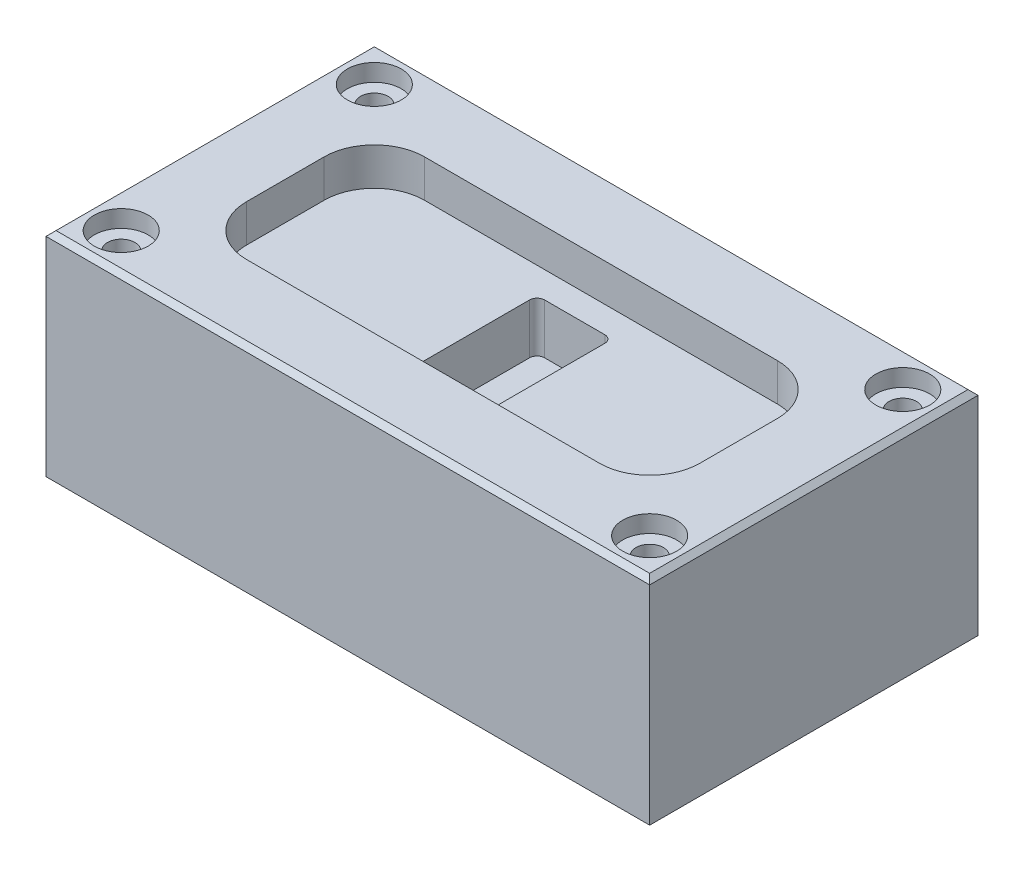
ISO-10303-21;
HEADER;
FILE_DESCRIPTION(('STEP AP214'),'2;1');
FILE_NAME('part.step','',(''),(''),'','','');
FILE_SCHEMA(('AUTOMOTIVE_DESIGN { 1 0 10303 214 1 1 1 1 }'));
ENDSEC;
DATA;
#1=APPLICATION_CONTEXT('core data for automotive mechanical design processes');
#2=APPLICATION_PROTOCOL_DEFINITION('international standard','automotive_design',2000,#1);
#3=PRODUCT_CONTEXT('',#1,'mechanical');
#4=PRODUCT('Part','Part','',(#3));
#5=PRODUCT_RELATED_PRODUCT_CATEGORY('part','',(#4));
#6=PRODUCT_DEFINITION_FORMATION('','',#4);
#7=PRODUCT_DEFINITION_CONTEXT('part definition',#1,'design');
#8=PRODUCT_DEFINITION('design','',#6,#7);
#9=PRODUCT_DEFINITION_SHAPE('','',#8);
#10=(LENGTH_UNIT() NAMED_UNIT(*) SI_UNIT(.MILLI.,.METRE.));
#11=(NAMED_UNIT(*) PLANE_ANGLE_UNIT() SI_UNIT($,.RADIAN.));
#12=(NAMED_UNIT(*) SI_UNIT($,.STERADIAN.) SOLID_ANGLE_UNIT());
#13=UNCERTAINTY_MEASURE_WITH_UNIT(LENGTH_MEASURE(1.E-05),#10,'distance_accuracy_value','');
#14=(GEOMETRIC_REPRESENTATION_CONTEXT(3) GLOBAL_UNCERTAINTY_ASSIGNED_CONTEXT((#13)) GLOBAL_UNIT_ASSIGNED_CONTEXT((#10,
#11,#12)) REPRESENTATION_CONTEXT('',''));
#15=CARTESIAN_POINT('',(0.,0.,0.));
#16=DIRECTION('',(0.,0.,1.));
#17=DIRECTION('',(1.,0.,0.));
#18=AXIS2_PLACEMENT_3D('',#15,#16,#17);
#19=CARTESIAN_POINT('',(120.382671357333,85.,65.4738352375261));
#20=DIRECTION('',(-1.,0.,0.));
#21=DIRECTION('',(0.,0.,1.));
#22=AXIS2_PLACEMENT_3D('',#19,#20,#21);
#23=PLANE('',#22);
#24=DIRECTION('',(0.,-1.,0.));
#25=VECTOR('',#24,1.);
#26=CARTESIAN_POINT('',(120.382671357333,85.,-65.4738352375261));
#27=LINE('',#26,#25);
#28=CARTESIAN_POINT('',(120.382671357333,82.9999999999999,-65.4738352375261));
#29=VERTEX_POINT('',#28);
#30=CARTESIAN_POINT('',(120.382671357333,0.,-65.4738352375261));
#31=VERTEX_POINT('',#30);
#32=EDGE_CURVE('E423',#29,#31,#27,.T.);
#33=ORIENTED_EDGE('',*,*,#32,.F.);
#34=DIRECTION('',(0.,0.,1.));
#35=VECTOR('',#34,1.);
#36=CARTESIAN_POINT('',(120.382671357333,82.9999999999999,65.4738352375261));
#37=LINE('',#36,#35);
#38=CARTESIAN_POINT('',(120.382671357333,82.9999999999999,65.4738352375261));
#39=VERTEX_POINT('',#38);
#40=EDGE_CURVE('E495',#29,#39,#37,.T.);
#41=ORIENTED_EDGE('',*,*,#40,.T.);
#42=DIRECTION('',(0.,-1.,0.));
#43=VECTOR('',#42,1.);
#44=CARTESIAN_POINT('',(120.382671357333,85.,65.4738352375261));
#45=LINE('',#44,#43);
#46=CARTESIAN_POINT('',(120.382671357333,0.,65.4738352375261));
#47=VERTEX_POINT('',#46);
#48=EDGE_CURVE('E414',#39,#47,#45,.T.);
#49=ORIENTED_EDGE('',*,*,#48,.T.);
#50=DIRECTION('',(0.,0.,-1.));
#51=VECTOR('',#50,1.);
#52=CARTESIAN_POINT('',(120.382671357333,0.,65.4738352375261));
#53=LINE('',#52,#51);
#54=EDGE_CURVE('E384',#47,#31,#53,.T.);
#55=ORIENTED_EDGE('',*,*,#54,.T.);
#56=EDGE_LOOP('',(#33,#41,#49,#55));
#57=FACE_BOUND('',#56,.T.);
#58=ADVANCED_FACE('F41',(#57),#23,.F.);
#59=CARTESIAN_POINT('',(-120.382671357333,85.,-65.4738352375261));
#60=DIRECTION('',(0.,0.,1.));
#61=DIRECTION('',(1.,0.,0.));
#62=AXIS2_PLACEMENT_3D('',#59,#60,#61);
#63=PLANE('',#62);
#64=DIRECTION('',(0.,-1.,0.));
#65=VECTOR('',#64,1.);
#66=CARTESIAN_POINT('',(-120.382671357333,85.,-65.4738352375261));
#67=LINE('',#66,#65);
#68=CARTESIAN_POINT('',(-120.382671357333,82.9999999999999,-65.4738352375261));
#69=VERTEX_POINT('',#68);
#70=CARTESIAN_POINT('',(-120.382671357333,0.,-65.4738352375261));
#71=VERTEX_POINT('',#70);
#72=EDGE_CURVE('E420',#69,#71,#67,.T.);
#73=ORIENTED_EDGE('',*,*,#72,.F.);
#74=DIRECTION('',(1.,0.,0.));
#75=VECTOR('',#74,1.);
#76=CARTESIAN_POINT('',(-120.382671357333,82.9999999999999,-65.4738352375261));
#77=LINE('',#76,#75);
#78=EDGE_CURVE('E52',#69,#29,#77,.T.);
#79=ORIENTED_EDGE('',*,*,#78,.T.);
#80=ORIENTED_EDGE('',*,*,#32,.T.);
#81=DIRECTION('',(-1.,0.,0.));
#82=VECTOR('',#81,1.);
#83=CARTESIAN_POINT('',(-120.382671357333,0.,-65.4738352375261));
#84=LINE('',#83,#82);
#85=EDGE_CURVE('E402',#31,#71,#84,.T.);
#86=ORIENTED_EDGE('',*,*,#85,.T.);
#87=EDGE_LOOP('',(#73,#79,#80,#86));
#88=FACE_BOUND('',#87,.T.);
#89=ADVANCED_FACE('F523',(#88),#63,.F.);
#90=CARTESIAN_POINT('',(-120.382671357333,85.,65.4738352375261));
#91=DIRECTION('',(1.,0.,0.));
#92=DIRECTION('',(0.,0.,-1.));
#93=AXIS2_PLACEMENT_3D('',#90,#91,#92);
#94=PLANE('',#93);
#95=DIRECTION('',(0.,-1.,0.));
#96=VECTOR('',#95,1.);
#97=CARTESIAN_POINT('',(-120.382671357333,85.,65.4738352375261));
#98=LINE('',#97,#96);
#99=CARTESIAN_POINT('',(-120.382671357333,82.9999999999999,65.4738352375261));
#100=VERTEX_POINT('',#99);
#101=CARTESIAN_POINT('',(-120.382671357333,0.,65.4738352375261));
#102=VERTEX_POINT('',#101);
#103=EDGE_CURVE('E417',#100,#102,#98,.T.);
#104=ORIENTED_EDGE('',*,*,#103,.F.);
#105=DIRECTION('',(0.,0.,-1.));
#106=VECTOR('',#105,1.);
#107=CARTESIAN_POINT('',(-120.382671357333,82.9999999999999,65.4738352375261));
#108=LINE('',#107,#106);
#109=EDGE_CURVE('E11',#100,#69,#108,.T.);
#110=ORIENTED_EDGE('',*,*,#109,.T.);
#111=ORIENTED_EDGE('',*,*,#72,.T.);
#112=DIRECTION('',(0.,0.,1.));
#113=VECTOR('',#112,1.);
#114=CARTESIAN_POINT('',(-120.382671357333,0.,65.4738352375261));
#115=LINE('',#114,#113);
#116=EDGE_CURVE('E406',#71,#102,#115,.T.);
#117=ORIENTED_EDGE('',*,*,#116,.T.);
#118=EDGE_LOOP('',(#104,#110,#111,#117));
#119=FACE_BOUND('',#118,.T.);
#120=ADVANCED_FACE('F532',(#119),#94,.F.);
#121=CARTESIAN_POINT('',(-120.382671357333,85.,65.4738352375261));
#122=DIRECTION('',(0.,0.,-1.));
#123=DIRECTION('',(-1.,0.,0.));
#124=AXIS2_PLACEMENT_3D('',#121,#122,#123);
#125=PLANE('',#124);
#126=ORIENTED_EDGE('',*,*,#48,.F.);
#127=DIRECTION('',(-1.,0.,0.));
#128=VECTOR('',#127,1.);
#129=CARTESIAN_POINT('',(-120.382671357333,82.9999999999999,65.4738352375261));
#130=LINE('',#129,#128);
#131=EDGE_CURVE('E491',#39,#100,#130,.T.);
#132=ORIENTED_EDGE('',*,*,#131,.T.);
#133=ORIENTED_EDGE('',*,*,#103,.T.);
#134=DIRECTION('',(1.,0.,0.));
#135=VECTOR('',#134,1.);
#136=CARTESIAN_POINT('',(-120.382671357333,0.,65.4738352375261));
#137=LINE('',#136,#135);
#138=EDGE_CURVE('E410',#102,#47,#137,.T.);
#139=ORIENTED_EDGE('',*,*,#138,.T.);
#140=EDGE_LOOP('',(#126,#132,#133,#139));
#141=FACE_BOUND('',#140,.T.);
#142=ADVANCED_FACE('F534',(#141),#125,.F.);
#143=CARTESIAN_POINT('',(0.,85.,0.));
#144=DIRECTION('',(0.,-1.,0.));
#145=DIRECTION('',(0.,0.,-1.));
#146=AXIS2_PLACEMENT_3D('',#143,#144,#145);
#147=PLANE('',#146);
#148=DIRECTION('',(0.,0.,1.));
#149=VECTOR('',#148,1.);
#150=CARTESIAN_POINT('',(-118.382671357333,85.,0.));
#151=LINE('',#150,#149);
#152=CARTESIAN_POINT('',(-118.382671357333,85.,-63.4738352375261));
#153=VERTEX_POINT('',#152);
#154=CARTESIAN_POINT('',(-118.382671357333,85.,63.4738352375261));
#155=VERTEX_POINT('',#154);
#156=EDGE_CURVE('E478',#153,#155,#151,.T.);
#157=ORIENTED_EDGE('',*,*,#156,.T.);
#158=DIRECTION('',(1.,0.,0.));
#159=VECTOR('',#158,1.);
#160=CARTESIAN_POINT('',(0.,85.,63.4738352375261));
#161=LINE('',#160,#159);
#162=CARTESIAN_POINT('',(118.382671357333,85.,63.4738352375261));
#163=VERTEX_POINT('',#162);
#164=EDGE_CURVE('E487',#155,#163,#161,.T.);
#165=ORIENTED_EDGE('',*,*,#164,.T.);
#166=DIRECTION('',(0.,0.,-1.));
#167=VECTOR('',#166,1.);
#168=CARTESIAN_POINT('',(118.382671357333,85.,0.));
#169=LINE('',#168,#167);
#170=CARTESIAN_POINT('',(118.382671357333,85.,-63.4738352375261));
#171=VERTEX_POINT('',#170);
#172=EDGE_CURVE('E484',#163,#171,#169,.T.);
#173=ORIENTED_EDGE('',*,*,#172,.T.);
#174=DIRECTION('',(-1.,0.,0.));
#175=VECTOR('',#174,1.);
#176=CARTESIAN_POINT('',(0.,85.,-63.4738352375261));
#177=LINE('',#176,#175);
#178=EDGE_CURVE('E481',#171,#153,#177,.T.);
#179=ORIENTED_EDGE('',*,*,#178,.T.);
#180=EDGE_LOOP('',(#157,#165,#173,#179));
#181=FACE_BOUND('',#180,.T.);
#182=CARTESIAN_POINT('',(-105.382671357333,85.,-50.4738352375261));
#183=DIRECTION('',(0.,1.,0.));
#184=DIRECTION('',(0.,0.,1.));
#185=AXIS2_PLACEMENT_3D('',#182,#183,#184);
#186=CIRCLE('',#185,10.74);
#187=CARTESIAN_POINT('',(-105.382671357333,85.,-39.7338352375261));
#188=VERTEX_POINT('',#187);
#189=EDGE_CURVE('E302',#188,#188,#186,.T.);
#190=ORIENTED_EDGE('',*,*,#189,.F.);
#191=EDGE_LOOP('',(#190));
#192=FACE_BOUND('',#191,.T.);
#193=CARTESIAN_POINT('',(-105.382671357333,85.,50.4738352375261));
#194=DIRECTION('',(0.,1.,0.));
#195=DIRECTION('',(0.,0.,1.));
#196=AXIS2_PLACEMENT_3D('',#193,#194,#195);
#197=CIRCLE('',#196,10.74);
#198=CARTESIAN_POINT('',(-105.382671357333,85.,61.2138352375261));
#199=VERTEX_POINT('',#198);
#200=EDGE_CURVE('E318',#199,#199,#197,.T.);
#201=ORIENTED_EDGE('',*,*,#200,.F.);
#202=EDGE_LOOP('',(#201));
#203=FACE_BOUND('',#202,.T.);
#204=CARTESIAN_POINT('',(105.382671357333,85.,-50.4738352375261));
#205=DIRECTION('',(0.,1.,0.));
#206=DIRECTION('',(0.,0.,1.));
#207=AXIS2_PLACEMENT_3D('',#204,#205,#206);
#208=CIRCLE('',#207,10.74);
#209=CARTESIAN_POINT('',(105.382671357333,85.,-39.7338352375261));
#210=VERTEX_POINT('',#209);
#211=EDGE_CURVE('E334',#210,#210,#208,.T.);
#212=ORIENTED_EDGE('',*,*,#211,.F.);
#213=EDGE_LOOP('',(#212));
#214=FACE_BOUND('',#213,.T.);
#215=CARTESIAN_POINT('',(105.382671357333,85.,50.4738352375261));
#216=DIRECTION('',(0.,1.,0.));
#217=DIRECTION('',(0.,0.,1.));
#218=AXIS2_PLACEMENT_3D('',#215,#216,#217);
#219=CIRCLE('',#218,10.74);
#220=CARTESIAN_POINT('',(105.382671357333,85.,61.2138352375261));
#221=VERTEX_POINT('',#220);
#222=EDGE_CURVE('E350',#221,#221,#219,.T.);
#223=ORIENTED_EDGE('',*,*,#222,.F.);
#224=EDGE_LOOP('',(#223));
#225=FACE_BOUND('',#224,.T.);
#226=DIRECTION('',(0.,0.,-1.));
#227=VECTOR('',#226,1.);
#228=CARTESIAN_POINT('',(90.3826713573335,85.,35.4738352375261));
#229=LINE('',#228,#227);
#230=CARTESIAN_POINT('',(90.3826713573335,85.,15.4738352375261));
#231=VERTEX_POINT('',#230);
#232=CARTESIAN_POINT('',(90.3826713573335,85.,-15.4738352375261));
#233=VERTEX_POINT('',#232);
#234=EDGE_CURVE('E388',#231,#233,#229,.T.);
#235=ORIENTED_EDGE('',*,*,#234,.F.);
#236=CARTESIAN_POINT('',(70.3826713573335,85.,15.4738352375261));
#237=DIRECTION('',(0.,-1.,0.));
#238=DIRECTION('',(0.,0.,-1.));
#239=AXIS2_PLACEMENT_3D('',#236,#237,#238);
#240=CIRCLE('',#239,20.);
#241=CARTESIAN_POINT('',(70.3826713573335,85.,35.4738352375261));
#242=VERTEX_POINT('',#241);
#243=EDGE_CURVE('E469',#231,#242,#240,.T.);
#244=ORIENTED_EDGE('',*,*,#243,.T.);
#245=DIRECTION('',(1.,0.,0.));
#246=VECTOR('',#245,1.);
#247=CARTESIAN_POINT('',(-90.3826713573335,85.,35.4738352375261));
#248=LINE('',#247,#246);
#249=CARTESIAN_POINT('',(-70.3826713573335,85.,35.4738352375261));
#250=VERTEX_POINT('',#249);
#251=EDGE_CURVE('E366',#250,#242,#248,.T.);
#252=ORIENTED_EDGE('',*,*,#251,.F.);
#253=CARTESIAN_POINT('',(-70.3826713573335,85.,15.4738352375261));
#254=DIRECTION('',(0.,-1.,0.));
#255=DIRECTION('',(0.,0.,-1.));
#256=AXIS2_PLACEMENT_3D('',#253,#254,#255);
#257=CIRCLE('',#256,20.);
#258=CARTESIAN_POINT('',(-90.3826713573335,85.,15.4738352375261));
#259=VERTEX_POINT('',#258);
#260=EDGE_CURVE('E466',#250,#259,#257,.T.);
#261=ORIENTED_EDGE('',*,*,#260,.T.);
#262=DIRECTION('',(0.,0.,1.));
#263=VECTOR('',#262,1.);
#264=CARTESIAN_POINT('',(-90.3826713573335,85.,-35.4738352375261));
#265=LINE('',#264,#263);
#266=CARTESIAN_POINT('',(-90.3826713573335,85.,-15.4738352375261));
#267=VERTEX_POINT('',#266);
#268=EDGE_CURVE('E372',#267,#259,#265,.T.);
#269=ORIENTED_EDGE('',*,*,#268,.F.);
#270=CARTESIAN_POINT('',(-70.3826713573335,85.,-15.4738352375261));
#271=DIRECTION('',(0.,-1.,0.));
#272=DIRECTION('',(0.,0.,-1.));
#273=AXIS2_PLACEMENT_3D('',#270,#271,#272);
#274=CIRCLE('',#273,20.);
#275=CARTESIAN_POINT('',(-70.3826713573335,85.,-35.4738352375261));
#276=VERTEX_POINT('',#275);
#277=EDGE_CURVE('E475',#267,#276,#274,.T.);
#278=ORIENTED_EDGE('',*,*,#277,.T.);
#279=DIRECTION('',(-1.,0.,0.));
#280=VECTOR('',#279,1.);
#281=CARTESIAN_POINT('',(90.3826713573335,85.,-35.4738352375261));
#282=LINE('',#281,#280);
#283=CARTESIAN_POINT('',(70.3826713573335,85.,-35.4738352375261));
#284=VERTEX_POINT('',#283);
#285=EDGE_CURVE('E392',#284,#276,#282,.T.);
#286=ORIENTED_EDGE('',*,*,#285,.F.);
#287=CARTESIAN_POINT('',(70.3826713573335,85.,-15.4738352375261));
#288=DIRECTION('',(0.,-1.,0.));
#289=DIRECTION('',(0.,0.,-1.));
#290=AXIS2_PLACEMENT_3D('',#287,#288,#289);
#291=CIRCLE('',#290,20.);
#292=EDGE_CURVE('E472',#284,#233,#291,.T.);
#293=ORIENTED_EDGE('',*,*,#292,.T.);
#294=EDGE_LOOP('',(#235,#244,#252,#261,#269,#278,#286,#293));
#295=FACE_BOUND('',#294,.T.);
#296=ADVANCED_FACE('F542',(#181,#192,#203,#214,#225,#295),#147,.F.);
#297=CARTESIAN_POINT('',(0.,0.,0.));
#298=DIRECTION('',(0.,-1.,0.));
#299=DIRECTION('',(0.,0.,-1.));
#300=AXIS2_PLACEMENT_3D('',#297,#298,#299);
#301=PLANE('',#300);
#302=ORIENTED_EDGE('',*,*,#54,.F.);
#303=ORIENTED_EDGE('',*,*,#138,.F.);
#304=ORIENTED_EDGE('',*,*,#116,.F.);
#305=ORIENTED_EDGE('',*,*,#85,.F.);
#306=EDGE_LOOP('',(#302,#303,#304,#305));
#307=FACE_BOUND('',#306,.T.);
#308=ADVANCED_FACE('F530',(#307),#301,.T.);
#309=CARTESIAN_POINT('',(-90.3826713573335,70.,35.4738352375261));
#310=DIRECTION('',(0.,0.,1.));
#311=DIRECTION('',(1.,0.,0.));
#312=AXIS2_PLACEMENT_3D('',#309,#310,#311);
#313=PLANE('',#312);
#314=DIRECTION('',(1.,0.,0.));
#315=VECTOR('',#314,1.);
#316=CARTESIAN_POINT('',(-90.3826713573335,70.,35.4738352375261));
#317=LINE('',#316,#315);
#318=CARTESIAN_POINT('',(-70.3826713573335,70.,35.4738352375261));
#319=VERTEX_POINT('',#318);
#320=CARTESIAN_POINT('',(70.3826713573335,70.,35.4738352375261));
#321=VERTEX_POINT('',#320);
#322=EDGE_CURVE('E367',#319,#321,#317,.T.);
#323=ORIENTED_EDGE('',*,*,#322,.F.);
#324=DIRECTION('',(0.,1.,0.));
#325=VECTOR('',#324,1.);
#326=CARTESIAN_POINT('',(-70.3826713573335,85.,35.4738352375261));
#327=LINE('',#326,#325);
#328=EDGE_CURVE('E429',#319,#250,#327,.T.);
#329=ORIENTED_EDGE('',*,*,#328,.T.);
#330=ORIENTED_EDGE('',*,*,#251,.T.);
#331=DIRECTION('',(0.,1.,0.));
#332=VECTOR('',#331,1.);
#333=CARTESIAN_POINT('',(70.3826713573335,70.,35.4738352375261));
#334=LINE('',#333,#332);
#335=EDGE_CURVE('E426',#242,#321,#334,.F.);
#336=ORIENTED_EDGE('',*,*,#335,.T.);
#337=EDGE_LOOP('',(#323,#329,#330,#336));
#338=FACE_BOUND('',#337,.T.);
#339=ADVANCED_FACE('F588',(#338),#313,.F.);
#340=CARTESIAN_POINT('',(-90.3826713573335,70.,-35.4738352375261));
#341=DIRECTION('',(-1.,0.,0.));
#342=DIRECTION('',(0.,0.,1.));
#343=AXIS2_PLACEMENT_3D('',#340,#341,#342);
#344=PLANE('',#343);
#345=ORIENTED_EDGE('',*,*,#268,.T.);
#346=DIRECTION('',(0.,1.,0.));
#347=VECTOR('',#346,1.);
#348=CARTESIAN_POINT('',(-90.3826713573335,70.,15.4738352375261));
#349=LINE('',#348,#347);
#350=CARTESIAN_POINT('',(-90.3826713573335,70.,15.4738352375261));
#351=VERTEX_POINT('',#350);
#352=EDGE_CURVE('E437',#259,#351,#349,.F.);
#353=ORIENTED_EDGE('',*,*,#352,.T.);
#354=DIRECTION('',(0.,0.,1.));
#355=VECTOR('',#354,1.);
#356=CARTESIAN_POINT('',(-90.3826713573335,70.,-35.4738352375261));
#357=LINE('',#356,#355);
#358=CARTESIAN_POINT('',(-90.3826713573335,70.,-15.4738352375261));
#359=VERTEX_POINT('',#358);
#360=EDGE_CURVE('E380',#359,#351,#357,.T.);
#361=ORIENTED_EDGE('',*,*,#360,.F.);
#362=DIRECTION('',(0.,1.,0.));
#363=VECTOR('',#362,1.);
#364=CARTESIAN_POINT('',(-90.3826713573335,85.,-15.4738352375261));
#365=LINE('',#364,#363);
#366=EDGE_CURVE('E433',#359,#267,#365,.T.);
#367=ORIENTED_EDGE('',*,*,#366,.T.);
#368=EDGE_LOOP('',(#345,#353,#361,#367));
#369=FACE_BOUND('',#368,.T.);
#370=ADVANCED_FACE('F579',(#369),#344,.F.);
#371=CARTESIAN_POINT('',(90.3826713573335,70.,-35.4738352375261));
#372=DIRECTION('',(0.,0.,-1.));
#373=DIRECTION('',(-1.,0.,0.));
#374=AXIS2_PLACEMENT_3D('',#371,#372,#373);
#375=PLANE('',#374);
#376=DIRECTION('',(-1.,0.,0.));
#377=VECTOR('',#376,1.);
#378=CARTESIAN_POINT('',(90.3826713573335,70.,-35.4738352375261));
#379=LINE('',#378,#377);
#380=CARTESIAN_POINT('',(70.3826713573335,70.,-35.4738352375261));
#381=VERTEX_POINT('',#380);
#382=CARTESIAN_POINT('',(-70.3826713573335,70.,-35.4738352375261));
#383=VERTEX_POINT('',#382);
#384=EDGE_CURVE('E376',#381,#383,#379,.T.);
#385=ORIENTED_EDGE('',*,*,#384,.F.);
#386=DIRECTION('',(0.,1.,0.));
#387=VECTOR('',#386,1.);
#388=CARTESIAN_POINT('',(70.3826713573335,85.,-35.4738352375261));
#389=LINE('',#388,#387);
#390=EDGE_CURVE('E462',#381,#284,#389,.T.);
#391=ORIENTED_EDGE('',*,*,#390,.T.);
#392=ORIENTED_EDGE('',*,*,#285,.T.);
#393=DIRECTION('',(0.,1.,0.));
#394=VECTOR('',#393,1.);
#395=CARTESIAN_POINT('',(-70.3826713573335,70.,-35.4738352375261));
#396=LINE('',#395,#394);
#397=EDGE_CURVE('E459',#276,#383,#396,.F.);
#398=ORIENTED_EDGE('',*,*,#397,.T.);
#399=EDGE_LOOP('',(#385,#391,#392,#398));
#400=FACE_BOUND('',#399,.T.);
#401=ADVANCED_FACE('F571',(#400),#375,.F.);
#402=CARTESIAN_POINT('',(90.3826713573335,70.,35.4738352375261));
#403=DIRECTION('',(1.,0.,0.));
#404=DIRECTION('',(0.,0.,-1.));
#405=AXIS2_PLACEMENT_3D('',#402,#403,#404);
#406=PLANE('',#405);
#407=DIRECTION('',(0.,0.,-1.));
#408=VECTOR('',#407,1.);
#409=CARTESIAN_POINT('',(90.3826713573335,70.,35.4738352375261));
#410=LINE('',#409,#408);
#411=CARTESIAN_POINT('',(90.3826713573335,70.,15.4738352375261));
#412=VERTEX_POINT('',#411);
#413=CARTESIAN_POINT('',(90.3826713573335,70.,-15.4738352375261));
#414=VERTEX_POINT('',#413);
#415=EDGE_CURVE('E371',#412,#414,#410,.T.);
#416=ORIENTED_EDGE('',*,*,#415,.F.);
#417=DIRECTION('',(0.,1.,0.));
#418=VECTOR('',#417,1.);
#419=CARTESIAN_POINT('',(90.3826713573335,85.,15.4738352375261));
#420=LINE('',#419,#418);
#421=EDGE_CURVE('E455',#412,#231,#420,.T.);
#422=ORIENTED_EDGE('',*,*,#421,.T.);
#423=ORIENTED_EDGE('',*,*,#234,.T.);
#424=DIRECTION('',(0.,1.,0.));
#425=VECTOR('',#424,1.);
#426=CARTESIAN_POINT('',(90.3826713573335,70.,-15.4738352375261));
#427=LINE('',#426,#425);
#428=EDGE_CURVE('E452',#233,#414,#427,.F.);
#429=ORIENTED_EDGE('',*,*,#428,.T.);
#430=EDGE_LOOP('',(#416,#422,#423,#429));
#431=FACE_BOUND('',#430,.T.);
#432=ADVANCED_FACE('F560',(#431),#406,.F.);
#433=CARTESIAN_POINT('',(0.,70.,0.));
#434=DIRECTION('',(0.,1.,0.));
#435=DIRECTION('',(0.,0.,1.));
#436=AXIS2_PLACEMENT_3D('',#433,#434,#435);
#437=PLANE('',#436);
#438=CARTESIAN_POINT('',(-12.,70.,22.));
#439=DIRECTION('',(0.,1.,0.));
#440=DIRECTION('',(0.,0.,-1.));
#441=AXIS2_PLACEMENT_3D('',#438,#439,#440);
#442=CIRCLE('',#441,3.);
#443=CARTESIAN_POINT('',(-15.,70.,22.));
#444=VERTEX_POINT('',#443);
#445=CARTESIAN_POINT('',(-12.,70.,25.));
#446=VERTEX_POINT('',#445);
#447=EDGE_CURVE('E212',#444,#446,#442,.T.);
#448=ORIENTED_EDGE('',*,*,#447,.F.);
#449=DIRECTION('',(0.,0.,1.));
#450=VECTOR('',#449,1.);
#451=CARTESIAN_POINT('',(-15.,70.,22.));
#452=LINE('',#451,#450);
#453=CARTESIAN_POINT('',(-15.,70.,-22.));
#454=VERTEX_POINT('',#453);
#455=EDGE_CURVE('E233',#454,#444,#452,.T.);
#456=ORIENTED_EDGE('',*,*,#455,.F.);
#457=CARTESIAN_POINT('',(-12.,70.,-22.));
#458=DIRECTION('',(0.,1.,0.));
#459=DIRECTION('',(0.,0.,-1.));
#460=AXIS2_PLACEMENT_3D('',#457,#458,#459);
#461=CIRCLE('',#460,3.);
#462=CARTESIAN_POINT('',(-12.,70.,-25.));
#463=VERTEX_POINT('',#462);
#464=EDGE_CURVE('E60',#463,#454,#461,.T.);
#465=ORIENTED_EDGE('',*,*,#464,.F.);
#466=DIRECTION('',(-1.,0.,0.));
#467=VECTOR('',#466,1.);
#468=CARTESIAN_POINT('',(-12.,70.,-25.));
#469=LINE('',#468,#467);
#470=CARTESIAN_POINT('',(12.,70.,-25.));
#471=VERTEX_POINT('',#470);
#472=EDGE_CURVE('E275',#471,#463,#469,.T.);
#473=ORIENTED_EDGE('',*,*,#472,.F.);
#474=CARTESIAN_POINT('',(12.,70.,-22.));
#475=DIRECTION('',(0.,1.,0.));
#476=DIRECTION('',(0.,0.,-1.));
#477=AXIS2_PLACEMENT_3D('',#474,#475,#476);
#478=CIRCLE('',#477,3.);
#479=CARTESIAN_POINT('',(15.,70.,-22.));
#480=VERTEX_POINT('',#479);
#481=EDGE_CURVE('E271',#480,#471,#478,.T.);
#482=ORIENTED_EDGE('',*,*,#481,.F.);
#483=DIRECTION('',(0.,0.,-1.));
#484=VECTOR('',#483,1.);
#485=CARTESIAN_POINT('',(15.,70.,22.));
#486=LINE('',#485,#484);
#487=CARTESIAN_POINT('',(15.,70.,22.));
#488=VERTEX_POINT('',#487);
#489=EDGE_CURVE('E267',#488,#480,#486,.T.);
#490=ORIENTED_EDGE('',*,*,#489,.F.);
#491=CARTESIAN_POINT('',(12.,70.,22.));
#492=DIRECTION('',(0.,1.,0.));
#493=DIRECTION('',(0.,0.,1.));
#494=AXIS2_PLACEMENT_3D('',#491,#492,#493);
#495=CIRCLE('',#494,3.);
#496=CARTESIAN_POINT('',(12.,70.,25.));
#497=VERTEX_POINT('',#496);
#498=EDGE_CURVE('E263',#497,#488,#495,.T.);
#499=ORIENTED_EDGE('',*,*,#498,.F.);
#500=DIRECTION('',(1.,0.,0.));
#501=VECTOR('',#500,1.);
#502=CARTESIAN_POINT('',(-12.,70.,25.));
#503=LINE('',#502,#501);
#504=EDGE_CURVE('E260',#446,#497,#503,.T.);
#505=ORIENTED_EDGE('',*,*,#504,.F.);
#506=EDGE_LOOP('',(#448,#456,#465,#473,#482,#490,#499,#505));
#507=FACE_BOUND('',#506,.T.);
#508=ORIENTED_EDGE('',*,*,#360,.T.);
#509=CARTESIAN_POINT('',(-70.3826713573335,70.,15.4738352375261));
#510=DIRECTION('',(0.,1.,0.));
#511=DIRECTION('',(0.,0.,1.));
#512=AXIS2_PLACEMENT_3D('',#509,#510,#511);
#513=CIRCLE('',#512,20.);
#514=EDGE_CURVE('E449',#351,#319,#513,.T.);
#515=ORIENTED_EDGE('',*,*,#514,.T.);
#516=ORIENTED_EDGE('',*,*,#322,.T.);
#517=CARTESIAN_POINT('',(70.3826713573335,70.,15.4738352375261));
#518=DIRECTION('',(0.,1.,0.));
#519=DIRECTION('',(0.,0.,1.));
#520=AXIS2_PLACEMENT_3D('',#517,#518,#519);
#521=CIRCLE('',#520,20.);
#522=EDGE_CURVE('E446',#321,#412,#521,.T.);
#523=ORIENTED_EDGE('',*,*,#522,.T.);
#524=ORIENTED_EDGE('',*,*,#415,.T.);
#525=CARTESIAN_POINT('',(70.3826713573335,70.,-15.4738352375261));
#526=DIRECTION('',(0.,1.,0.));
#527=DIRECTION('',(0.,0.,1.));
#528=AXIS2_PLACEMENT_3D('',#525,#526,#527);
#529=CIRCLE('',#528,20.);
#530=EDGE_CURVE('E443',#414,#381,#529,.T.);
#531=ORIENTED_EDGE('',*,*,#530,.T.);
#532=ORIENTED_EDGE('',*,*,#384,.T.);
#533=CARTESIAN_POINT('',(-70.3826713573335,70.,-15.4738352375261));
#534=DIRECTION('',(0.,1.,0.));
#535=DIRECTION('',(0.,0.,1.));
#536=AXIS2_PLACEMENT_3D('',#533,#534,#535);
#537=CIRCLE('',#536,20.);
#538=EDGE_CURVE('E440',#383,#359,#537,.T.);
#539=ORIENTED_EDGE('',*,*,#538,.T.);
#540=EDGE_LOOP('',(#508,#515,#516,#523,#524,#531,#532,#539));
#541=FACE_BOUND('',#540,.T.);
#542=ADVANCED_FACE('F568',(#507,#541),#437,.T.);
#543=CARTESIAN_POINT('',(105.382671357333,65.,50.4738352375261));
#544=DIRECTION('',(0.,1.,0.));
#545=DIRECTION('',(0.,0.,1.));
#546=AXIS2_PLACEMENT_3D('',#543,#544,#545);
#547=CONICAL_SURFACE('',#546,5.49999999999999,1.02974425867665);
#548=CARTESIAN_POINT('',(105.382671357333,61.6952665953484,50.4738352375261));
#549=VERTEX_POINT('',#548);
#550=VERTEX_LOOP('',#549);
#551=FACE_BOUND('',#550,.T.);
#552=CARTESIAN_POINT('',(105.382671357333,65.,50.4738352375261));
#553=DIRECTION('',(0.,1.,0.));
#554=DIRECTION('',(0.,0.,1.));
#555=AXIS2_PLACEMENT_3D('',#552,#553,#554);
#556=CIRCLE('',#555,5.49999999999999);
#557=CARTESIAN_POINT('',(105.382671357333,65.,55.9738352375261));
#558=VERTEX_POINT('',#557);
#559=EDGE_CURVE('E362',#558,#558,#556,.T.);
#560=ORIENTED_EDGE('',*,*,#559,.T.);
#561=EDGE_LOOP('',(#560));
#562=FACE_BOUND('',#561,.T.);
#563=ADVANCED_FACE('F624',(#551,#562),#547,.F.);
#564=CARTESIAN_POINT('',(105.382671357333,85.,50.4738352375261));
#565=DIRECTION('',(0.,1.,0.));
#566=DIRECTION('',(0.,0.,1.));
#567=AXIS2_PLACEMENT_3D('',#564,#565,#566);
#568=CYLINDRICAL_SURFACE('',#567,5.49999999999999);
#569=ORIENTED_EDGE('',*,*,#559,.F.);
#570=EDGE_LOOP('',(#569));
#571=FACE_BOUND('',#570,.T.);
#572=CARTESIAN_POINT('',(105.382671357333,78.15,50.4738352375261));
#573=DIRECTION('',(0.,1.,0.));
#574=DIRECTION('',(0.,0.,1.));
#575=AXIS2_PLACEMENT_3D('',#572,#573,#574);
#576=CIRCLE('',#575,5.49999999999999);
#577=CARTESIAN_POINT('',(105.382671357333,78.15,55.9738352375261));
#578=VERTEX_POINT('',#577);
#579=EDGE_CURVE('E358',#578,#578,#576,.T.);
#580=ORIENTED_EDGE('',*,*,#579,.T.);
#581=EDGE_LOOP('',(#580));
#582=FACE_BOUND('',#581,.T.);
#583=ADVANCED_FACE('F628',(#571,#582),#568,.F.);
#584=CARTESIAN_POINT('',(110.882671357333,78.15,50.4738352375261));
#585=DIRECTION('',(0.,-1.,0.));
#586=DIRECTION('',(0.,0.,-1.));
#587=AXIS2_PLACEMENT_3D('',#584,#585,#586);
#588=PLANE('',#587);
#589=ORIENTED_EDGE('',*,*,#579,.F.);
#590=EDGE_LOOP('',(#589));
#591=FACE_BOUND('',#590,.T.);
#592=CARTESIAN_POINT('',(105.382671357333,78.15,50.4738352375261));
#593=DIRECTION('',(0.,1.,0.));
#594=DIRECTION('',(0.,0.,1.));
#595=AXIS2_PLACEMENT_3D('',#592,#593,#594);
#596=CIRCLE('',#595,10.74);
#597=CARTESIAN_POINT('',(105.382671357333,78.15,61.2138352375261));
#598=VERTEX_POINT('',#597);
#599=EDGE_CURVE('E354',#598,#598,#596,.T.);
#600=ORIENTED_EDGE('',*,*,#599,.T.);
#601=EDGE_LOOP('',(#600));
#602=FACE_BOUND('',#601,.T.);
#603=ADVANCED_FACE('F632',(#591,#602),#588,.F.);
#604=CARTESIAN_POINT('',(105.382671357333,85.,50.4738352375261));
#605=DIRECTION('',(0.,1.,0.));
#606=DIRECTION('',(0.,0.,1.));
#607=AXIS2_PLACEMENT_3D('',#604,#605,#606);
#608=CYLINDRICAL_SURFACE('',#607,10.74);
#609=ORIENTED_EDGE('',*,*,#599,.F.);
#610=EDGE_LOOP('',(#609));
#611=FACE_BOUND('',#610,.T.);
#612=ORIENTED_EDGE('',*,*,#222,.T.);
#613=EDGE_LOOP('',(#612));
#614=FACE_BOUND('',#613,.T.);
#615=ADVANCED_FACE('F636',(#611,#614),#608,.F.);
#616=CARTESIAN_POINT('',(105.382671357333,65.,-50.4738352375261));
#617=DIRECTION('',(0.,1.,0.));
#618=DIRECTION('',(0.,0.,1.));
#619=AXIS2_PLACEMENT_3D('',#616,#617,#618);
#620=CONICAL_SURFACE('',#619,5.49999999999999,1.02974425867665);
#621=CARTESIAN_POINT('',(105.382671357333,61.6952665953484,-50.4738352375261));
#622=VERTEX_POINT('',#621);
#623=VERTEX_LOOP('',#622);
#624=FACE_BOUND('',#623,.T.);
#625=CARTESIAN_POINT('',(105.382671357333,65.,-50.4738352375261));
#626=DIRECTION('',(0.,1.,0.));
#627=DIRECTION('',(0.,0.,1.));
#628=AXIS2_PLACEMENT_3D('',#625,#626,#627);
#629=CIRCLE('',#628,5.49999999999999);
#630=CARTESIAN_POINT('',(105.382671357333,65.,-44.9738352375262));
#631=VERTEX_POINT('',#630);
#632=EDGE_CURVE('E346',#631,#631,#629,.T.);
#633=ORIENTED_EDGE('',*,*,#632,.T.);
#634=EDGE_LOOP('',(#633));
#635=FACE_BOUND('',#634,.T.);
#636=ADVANCED_FACE('F640',(#624,#635),#620,.F.);
#637=CARTESIAN_POINT('',(105.382671357333,85.,-50.4738352375261));
#638=DIRECTION('',(0.,1.,0.));
#639=DIRECTION('',(0.,0.,1.));
#640=AXIS2_PLACEMENT_3D('',#637,#638,#639);
#641=CYLINDRICAL_SURFACE('',#640,5.49999999999999);
#642=ORIENTED_EDGE('',*,*,#632,.F.);
#643=EDGE_LOOP('',(#642));
#644=FACE_BOUND('',#643,.T.);
#645=CARTESIAN_POINT('',(105.382671357333,78.15,-50.4738352375261));
#646=DIRECTION('',(0.,1.,0.));
#647=DIRECTION('',(0.,0.,1.));
#648=AXIS2_PLACEMENT_3D('',#645,#646,#647);
#649=CIRCLE('',#648,5.49999999999999);
#650=CARTESIAN_POINT('',(105.382671357333,78.15,-44.9738352375262));
#651=VERTEX_POINT('',#650);
#652=EDGE_CURVE('E342',#651,#651,#649,.T.);
#653=ORIENTED_EDGE('',*,*,#652,.T.);
#654=EDGE_LOOP('',(#653));
#655=FACE_BOUND('',#654,.T.);
#656=ADVANCED_FACE('F644',(#644,#655),#641,.F.);
#657=CARTESIAN_POINT('',(110.882671357333,78.15,-50.4738352375261));
#658=DIRECTION('',(0.,-1.,0.));
#659=DIRECTION('',(0.,0.,-1.));
#660=AXIS2_PLACEMENT_3D('',#657,#658,#659);
#661=PLANE('',#660);
#662=ORIENTED_EDGE('',*,*,#652,.F.);
#663=EDGE_LOOP('',(#662));
#664=FACE_BOUND('',#663,.T.);
#665=CARTESIAN_POINT('',(105.382671357333,78.15,-50.4738352375261));
#666=DIRECTION('',(0.,1.,0.));
#667=DIRECTION('',(0.,0.,1.));
#668=AXIS2_PLACEMENT_3D('',#665,#666,#667);
#669=CIRCLE('',#668,10.74);
#670=CARTESIAN_POINT('',(105.382671357333,78.15,-39.7338352375261));
#671=VERTEX_POINT('',#670);
#672=EDGE_CURVE('E338',#671,#671,#669,.T.);
#673=ORIENTED_EDGE('',*,*,#672,.T.);
#674=EDGE_LOOP('',(#673));
#675=FACE_BOUND('',#674,.T.);
#676=ADVANCED_FACE('F648',(#664,#675),#661,.F.);
#677=CARTESIAN_POINT('',(105.382671357333,85.,-50.4738352375261));
#678=DIRECTION('',(0.,1.,0.));
#679=DIRECTION('',(0.,0.,1.));
#680=AXIS2_PLACEMENT_3D('',#677,#678,#679);
#681=CYLINDRICAL_SURFACE('',#680,10.74);
#682=ORIENTED_EDGE('',*,*,#672,.F.);
#683=EDGE_LOOP('',(#682));
#684=FACE_BOUND('',#683,.T.);
#685=ORIENTED_EDGE('',*,*,#211,.T.);
#686=EDGE_LOOP('',(#685));
#687=FACE_BOUND('',#686,.T.);
#688=ADVANCED_FACE('F652',(#684,#687),#681,.F.);
#689=CARTESIAN_POINT('',(-105.382671357333,65.,50.4738352375261));
#690=DIRECTION('',(0.,1.,0.));
#691=DIRECTION('',(0.,0.,1.));
#692=AXIS2_PLACEMENT_3D('',#689,#690,#691);
#693=CONICAL_SURFACE('',#692,5.49999999999999,1.02974425867665);
#694=CARTESIAN_POINT('',(-105.382671357333,61.6952665953484,50.4738352375261));
#695=VERTEX_POINT('',#694);
#696=VERTEX_LOOP('',#695);
#697=FACE_BOUND('',#696,.T.);
#698=CARTESIAN_POINT('',(-105.382671357333,65.,50.4738352375261));
#699=DIRECTION('',(0.,1.,0.));
#700=DIRECTION('',(0.,0.,1.));
#701=AXIS2_PLACEMENT_3D('',#698,#699,#700);
#702=CIRCLE('',#701,5.49999999999999);
#703=CARTESIAN_POINT('',(-105.382671357333,65.,55.9738352375261));
#704=VERTEX_POINT('',#703);
#705=EDGE_CURVE('E330',#704,#704,#702,.T.);
#706=ORIENTED_EDGE('',*,*,#705,.T.);
#707=EDGE_LOOP('',(#706));
#708=FACE_BOUND('',#707,.T.);
#709=ADVANCED_FACE('F656',(#697,#708),#693,.F.);
#710=CARTESIAN_POINT('',(-105.382671357333,85.,50.4738352375261));
#711=DIRECTION('',(0.,1.,0.));
#712=DIRECTION('',(0.,0.,1.));
#713=AXIS2_PLACEMENT_3D('',#710,#711,#712);
#714=CYLINDRICAL_SURFACE('',#713,5.49999999999999);
#715=ORIENTED_EDGE('',*,*,#705,.F.);
#716=EDGE_LOOP('',(#715));
#717=FACE_BOUND('',#716,.T.);
#718=CARTESIAN_POINT('',(-105.382671357333,78.15,50.4738352375261));
#719=DIRECTION('',(0.,1.,0.));
#720=DIRECTION('',(0.,0.,1.));
#721=AXIS2_PLACEMENT_3D('',#718,#719,#720);
#722=CIRCLE('',#721,5.49999999999999);
#723=CARTESIAN_POINT('',(-105.382671357333,78.15,55.9738352375261));
#724=VERTEX_POINT('',#723);
#725=EDGE_CURVE('E326',#724,#724,#722,.T.);
#726=ORIENTED_EDGE('',*,*,#725,.T.);
#727=EDGE_LOOP('',(#726));
#728=FACE_BOUND('',#727,.T.);
#729=ADVANCED_FACE('F660',(#717,#728),#714,.F.);
#730=CARTESIAN_POINT('',(-99.8826713573335,78.15,50.4738352375261));
#731=DIRECTION('',(0.,-1.,0.));
#732=DIRECTION('',(0.,0.,-1.));
#733=AXIS2_PLACEMENT_3D('',#730,#731,#732);
#734=PLANE('',#733);
#735=ORIENTED_EDGE('',*,*,#725,.F.);
#736=EDGE_LOOP('',(#735));
#737=FACE_BOUND('',#736,.T.);
#738=CARTESIAN_POINT('',(-105.382671357333,78.15,50.4738352375261));
#739=DIRECTION('',(0.,1.,0.));
#740=DIRECTION('',(0.,0.,1.));
#741=AXIS2_PLACEMENT_3D('',#738,#739,#740);
#742=CIRCLE('',#741,10.74);
#743=CARTESIAN_POINT('',(-105.382671357333,78.15,61.2138352375261));
#744=VERTEX_POINT('',#743);
#745=EDGE_CURVE('E322',#744,#744,#742,.T.);
#746=ORIENTED_EDGE('',*,*,#745,.T.);
#747=EDGE_LOOP('',(#746));
#748=FACE_BOUND('',#747,.T.);
#749=ADVANCED_FACE('F664',(#737,#748),#734,.F.);
#750=CARTESIAN_POINT('',(-105.382671357333,85.,50.4738352375261));
#751=DIRECTION('',(0.,1.,0.));
#752=DIRECTION('',(0.,0.,1.));
#753=AXIS2_PLACEMENT_3D('',#750,#751,#752);
#754=CYLINDRICAL_SURFACE('',#753,10.74);
#755=ORIENTED_EDGE('',*,*,#745,.F.);
#756=EDGE_LOOP('',(#755));
#757=FACE_BOUND('',#756,.T.);
#758=ORIENTED_EDGE('',*,*,#200,.T.);
#759=EDGE_LOOP('',(#758));
#760=FACE_BOUND('',#759,.T.);
#761=ADVANCED_FACE('F668',(#757,#760),#754,.F.);
#762=CARTESIAN_POINT('',(-105.382671357333,65.,-50.4738352375261));
#763=DIRECTION('',(0.,1.,0.));
#764=DIRECTION('',(0.,0.,1.));
#765=AXIS2_PLACEMENT_3D('',#762,#763,#764);
#766=CONICAL_SURFACE('',#765,5.49999999999999,1.02974425867665);
#767=CARTESIAN_POINT('',(-105.382671357333,61.6952665953484,-50.4738352375261));
#768=VERTEX_POINT('',#767);
#769=VERTEX_LOOP('',#768);
#770=FACE_BOUND('',#769,.T.);
#771=CARTESIAN_POINT('',(-105.382671357333,65.,-50.4738352375261));
#772=DIRECTION('',(0.,1.,0.));
#773=DIRECTION('',(0.,0.,1.));
#774=AXIS2_PLACEMENT_3D('',#771,#772,#773);
#775=CIRCLE('',#774,5.49999999999999);
#776=CARTESIAN_POINT('',(-105.382671357333,65.,-44.9738352375262));
#777=VERTEX_POINT('',#776);
#778=EDGE_CURVE('E314',#777,#777,#775,.T.);
#779=ORIENTED_EDGE('',*,*,#778,.T.);
#780=EDGE_LOOP('',(#779));
#781=FACE_BOUND('',#780,.T.);
#782=ADVANCED_FACE('F672',(#770,#781),#766,.F.);
#783=CARTESIAN_POINT('',(-105.382671357333,85.,-50.4738352375261));
#784=DIRECTION('',(0.,1.,0.));
#785=DIRECTION('',(0.,0.,1.));
#786=AXIS2_PLACEMENT_3D('',#783,#784,#785);
#787=CYLINDRICAL_SURFACE('',#786,5.49999999999999);
#788=ORIENTED_EDGE('',*,*,#778,.F.);
#789=EDGE_LOOP('',(#788));
#790=FACE_BOUND('',#789,.T.);
#791=CARTESIAN_POINT('',(-105.382671357333,78.15,-50.4738352375261));
#792=DIRECTION('',(0.,1.,0.));
#793=DIRECTION('',(0.,0.,1.));
#794=AXIS2_PLACEMENT_3D('',#791,#792,#793);
#795=CIRCLE('',#794,5.49999999999999);
#796=CARTESIAN_POINT('',(-105.382671357333,78.15,-44.9738352375262));
#797=VERTEX_POINT('',#796);
#798=EDGE_CURVE('E310',#797,#797,#795,.T.);
#799=ORIENTED_EDGE('',*,*,#798,.T.);
#800=EDGE_LOOP('',(#799));
#801=FACE_BOUND('',#800,.T.);
#802=ADVANCED_FACE('F676',(#790,#801),#787,.F.);
#803=CARTESIAN_POINT('',(-99.8826713573335,78.15,-50.4738352375261));
#804=DIRECTION('',(0.,-1.,0.));
#805=DIRECTION('',(0.,0.,-1.));
#806=AXIS2_PLACEMENT_3D('',#803,#804,#805);
#807=PLANE('',#806);
#808=ORIENTED_EDGE('',*,*,#798,.F.);
#809=EDGE_LOOP('',(#808));
#810=FACE_BOUND('',#809,.T.);
#811=CARTESIAN_POINT('',(-105.382671357333,78.15,-50.4738352375261));
#812=DIRECTION('',(0.,1.,0.));
#813=DIRECTION('',(0.,0.,1.));
#814=AXIS2_PLACEMENT_3D('',#811,#812,#813);
#815=CIRCLE('',#814,10.74);
#816=CARTESIAN_POINT('',(-105.382671357333,78.15,-39.7338352375261));
#817=VERTEX_POINT('',#816);
#818=EDGE_CURVE('E306',#817,#817,#815,.T.);
#819=ORIENTED_EDGE('',*,*,#818,.T.);
#820=EDGE_LOOP('',(#819));
#821=FACE_BOUND('',#820,.T.);
#822=ADVANCED_FACE('F680',(#810,#821),#807,.F.);
#823=CARTESIAN_POINT('',(-105.382671357333,85.,-50.4738352375261));
#824=DIRECTION('',(0.,1.,0.));
#825=DIRECTION('',(0.,0.,1.));
#826=AXIS2_PLACEMENT_3D('',#823,#824,#825);
#827=CYLINDRICAL_SURFACE('',#826,10.74);
#828=ORIENTED_EDGE('',*,*,#818,.F.);
#829=EDGE_LOOP('',(#828));
#830=FACE_BOUND('',#829,.T.);
#831=ORIENTED_EDGE('',*,*,#189,.T.);
#832=EDGE_LOOP('',(#831));
#833=FACE_BOUND('',#832,.T.);
#834=ADVANCED_FACE('F599',(#830,#833),#827,.F.);
#835=CARTESIAN_POINT('',(-70.3826713573335,70.,15.4738352375261));
#836=DIRECTION('',(0.,-1.,0.));
#837=DIRECTION('',(0.,0.,-1.));
#838=AXIS2_PLACEMENT_3D('',#835,#836,#837);
#839=CYLINDRICAL_SURFACE('',#838,20.);
#840=ORIENTED_EDGE('',*,*,#514,.F.);
#841=ORIENTED_EDGE('',*,*,#352,.F.);
#842=ORIENTED_EDGE('',*,*,#260,.F.);
#843=ORIENTED_EDGE('',*,*,#328,.F.);
#844=EDGE_LOOP('',(#840,#841,#842,#843));
#845=FACE_BOUND('',#844,.T.);
#846=ADVANCED_FACE('F583',(#845),#839,.F.);
#847=CARTESIAN_POINT('',(70.3826713573335,70.,15.4738352375261));
#848=DIRECTION('',(0.,-1.,0.));
#849=DIRECTION('',(0.,0.,-1.));
#850=AXIS2_PLACEMENT_3D('',#847,#848,#849);
#851=CYLINDRICAL_SURFACE('',#850,20.);
#852=ORIENTED_EDGE('',*,*,#522,.F.);
#853=ORIENTED_EDGE('',*,*,#335,.F.);
#854=ORIENTED_EDGE('',*,*,#243,.F.);
#855=ORIENTED_EDGE('',*,*,#421,.F.);
#856=EDGE_LOOP('',(#852,#853,#854,#855));
#857=FACE_BOUND('',#856,.T.);
#858=ADVANCED_FACE('F591',(#857),#851,.F.);
#859=CARTESIAN_POINT('',(70.3826713573335,70.,-15.4738352375261));
#860=DIRECTION('',(0.,-1.,0.));
#861=DIRECTION('',(0.,0.,-1.));
#862=AXIS2_PLACEMENT_3D('',#859,#860,#861);
#863=CYLINDRICAL_SURFACE('',#862,20.);
#864=ORIENTED_EDGE('',*,*,#530,.F.);
#865=ORIENTED_EDGE('',*,*,#428,.F.);
#866=ORIENTED_EDGE('',*,*,#292,.F.);
#867=ORIENTED_EDGE('',*,*,#390,.F.);
#868=EDGE_LOOP('',(#864,#865,#866,#867));
#869=FACE_BOUND('',#868,.T.);
#870=ADVANCED_FACE('F564',(#869),#863,.F.);
#871=CARTESIAN_POINT('',(-70.3826713573335,70.,-15.4738352375261));
#872=DIRECTION('',(0.,-1.,0.));
#873=DIRECTION('',(0.,0.,-1.));
#874=AXIS2_PLACEMENT_3D('',#871,#872,#873);
#875=CYLINDRICAL_SURFACE('',#874,20.);
#876=ORIENTED_EDGE('',*,*,#538,.F.);
#877=ORIENTED_EDGE('',*,*,#397,.F.);
#878=ORIENTED_EDGE('',*,*,#277,.F.);
#879=ORIENTED_EDGE('',*,*,#366,.F.);
#880=EDGE_LOOP('',(#876,#877,#878,#879));
#881=FACE_BOUND('',#880,.T.);
#882=ADVANCED_FACE('F574',(#881),#875,.F.);
#883=CARTESIAN_POINT('',(0.,85.,-63.4738352375261));
#884=DIRECTION('',(0.,-0.707106781186543,0.707106781186552));
#885=DIRECTION('',(-1.,0.,0.));
#886=AXIS2_PLACEMENT_3D('',#883,#884,#885);
#887=PLANE('',#886);
#888=DIRECTION('',(0.577350269189623,-0.577350269189631,-0.577350269189623));
#889=VECTOR('',#888,1.);
#890=CARTESIAN_POINT('',(78.9217809048893,124.460890452445,-24.012944785082));
#891=LINE('',#890,#889);
#892=EDGE_CURVE('E504',#29,#171,#891,.F.);
#893=ORIENTED_EDGE('',*,*,#892,.F.);
#894=ORIENTED_EDGE('',*,*,#78,.F.);
#895=DIRECTION('',(-0.577350269189623,-0.577350269189631,-0.577350269189623));
#896=VECTOR('',#895,1.);
#897=CARTESIAN_POINT('',(-97.2247262781583,106.157945079175,-42.3158901583509));
#898=LINE('',#897,#896);
#899=EDGE_CURVE('E46',#153,#69,#898,.T.);
#900=ORIENTED_EDGE('',*,*,#899,.F.);
#901=ORIENTED_EDGE('',*,*,#178,.F.);
#902=EDGE_LOOP('',(#893,#894,#900,#901));
#903=FACE_BOUND('',#902,.T.);
#904=ADVANCED_FACE('F44',(#903),#887,.F.);
#905=CARTESIAN_POINT('',(-118.382671357333,85.,0.));
#906=DIRECTION('',(0.707106781186552,-0.707106781186543,0.));
#907=DIRECTION('',(0.,0.,1.));
#908=AXIS2_PLACEMENT_3D('',#905,#906,#907);
#909=PLANE('',#908);
#910=ORIENTED_EDGE('',*,*,#899,.T.);
#911=ORIENTED_EDGE('',*,*,#109,.F.);
#912=DIRECTION('',(0.577350269189623,0.577350269189631,-0.577350269189623));
#913=VECTOR('',#912,1.);
#914=CARTESIAN_POINT('',(-97.2247262781583,106.157945079175,42.3158901583509));
#915=LINE('',#914,#913);
#916=EDGE_CURVE('E502',#155,#100,#915,.F.);
#917=ORIENTED_EDGE('',*,*,#916,.F.);
#918=ORIENTED_EDGE('',*,*,#156,.F.);
#919=EDGE_LOOP('',(#910,#911,#917,#918));
#920=FACE_BOUND('',#919,.T.);
#921=ADVANCED_FACE('F516',(#920),#909,.F.);
#922=CARTESIAN_POINT('',(118.382671357333,85.,0.));
#923=DIRECTION('',(-0.707106781186552,-0.707106781186543,0.));
#924=DIRECTION('',(0.,0.,-1.));
#925=AXIS2_PLACEMENT_3D('',#922,#923,#924);
#926=PLANE('',#925);
#927=ORIENTED_EDGE('',*,*,#892,.T.);
#928=ORIENTED_EDGE('',*,*,#172,.F.);
#929=DIRECTION('',(0.577350269189623,-0.577350269189631,0.577350269189623));
#930=VECTOR('',#929,1.);
#931=CARTESIAN_POINT('',(97.2247262781583,106.157945079175,42.3158901583509));
#932=LINE('',#931,#930);
#933=EDGE_CURVE('E284',#39,#163,#932,.F.);
#934=ORIENTED_EDGE('',*,*,#933,.F.);
#935=ORIENTED_EDGE('',*,*,#40,.F.);
#936=EDGE_LOOP('',(#927,#928,#934,#935));
#937=FACE_BOUND('',#936,.T.);
#938=ADVANCED_FACE('F540',(#937),#926,.F.);
#939=CARTESIAN_POINT('',(0.,85.,63.4738352375261));
#940=DIRECTION('',(0.,-0.707106781186543,-0.707106781186552));
#941=DIRECTION('',(1.,0.,0.));
#942=AXIS2_PLACEMENT_3D('',#939,#940,#941);
#943=PLANE('',#942);
#944=ORIENTED_EDGE('',*,*,#916,.T.);
#945=ORIENTED_EDGE('',*,*,#131,.F.);
#946=ORIENTED_EDGE('',*,*,#933,.T.);
#947=ORIENTED_EDGE('',*,*,#164,.F.);
#948=EDGE_LOOP('',(#944,#945,#946,#947));
#949=FACE_BOUND('',#948,.T.);
#950=ADVANCED_FACE('F538',(#949),#943,.F.);
#951=CARTESIAN_POINT('',(-12.,50.,22.));
#952=DIRECTION('',(0.,1.,0.));
#953=DIRECTION('',(0.,0.,1.));
#954=AXIS2_PLACEMENT_3D('',#951,#952,#953);
#955=CYLINDRICAL_SURFACE('',#954,3.);
#956=ORIENTED_EDGE('',*,*,#447,.T.);
#957=DIRECTION('',(0.,1.,0.));
#958=VECTOR('',#957,1.);
#959=CARTESIAN_POINT('',(-12.,50.,25.));
#960=LINE('',#959,#958);
#961=CARTESIAN_POINT('',(-12.,50.,25.));
#962=VERTEX_POINT('',#961);
#963=EDGE_CURVE('E205',#962,#446,#960,.T.);
#964=ORIENTED_EDGE('',*,*,#963,.F.);
#965=CARTESIAN_POINT('',(-12.,50.,22.));
#966=DIRECTION('',(0.,1.,0.));
#967=DIRECTION('',(0.,0.,-1.));
#968=AXIS2_PLACEMENT_3D('',#965,#966,#967);
#969=CIRCLE('',#968,3.);
#970=CARTESIAN_POINT('',(-15.,50.,22.));
#971=VERTEX_POINT('',#970);
#972=EDGE_CURVE('E209',#971,#962,#969,.T.);
#973=ORIENTED_EDGE('',*,*,#972,.F.);
#974=DIRECTION('',(0.,1.,0.));
#975=VECTOR('',#974,1.);
#976=CARTESIAN_POINT('',(-15.,50.,22.));
#977=LINE('',#976,#975);
#978=EDGE_CURVE('E281',#971,#444,#977,.T.);
#979=ORIENTED_EDGE('',*,*,#978,.T.);
#980=EDGE_LOOP('',(#956,#964,#973,#979));
#981=FACE_BOUND('',#980,.T.);
#982=ADVANCED_FACE('F207',(#981),#955,.F.);
#983=CARTESIAN_POINT('',(-15.,50.,22.));
#984=DIRECTION('',(-1.,0.,0.));
#985=DIRECTION('',(0.,0.,1.));
#986=AXIS2_PLACEMENT_3D('',#983,#984,#985);
#987=PLANE('',#986);
#988=ORIENTED_EDGE('',*,*,#455,.T.);
#989=ORIENTED_EDGE('',*,*,#978,.F.);
#990=DIRECTION('',(0.,0.,1.));
#991=VECTOR('',#990,1.);
#992=CARTESIAN_POINT('',(-15.,50.,22.));
#993=LINE('',#992,#991);
#994=CARTESIAN_POINT('',(-15.,50.,-22.));
#995=VERTEX_POINT('',#994);
#996=EDGE_CURVE('E218',#995,#971,#993,.T.);
#997=ORIENTED_EDGE('',*,*,#996,.F.);
#998=DIRECTION('',(0.,1.,0.));
#999=VECTOR('',#998,1.);
#1000=CARTESIAN_POINT('',(-15.,50.,-22.));
#1001=LINE('',#1000,#999);
#1002=EDGE_CURVE('E285',#995,#454,#1001,.T.);
#1003=ORIENTED_EDGE('',*,*,#1002,.T.);
#1004=EDGE_LOOP('',(#988,#989,#997,#1003));
#1005=FACE_BOUND('',#1004,.T.);
#1006=ADVANCED_FACE('F690',(#1005),#987,.F.);
#1007=CARTESIAN_POINT('',(-12.,50.,-22.));
#1008=DIRECTION('',(0.,1.,0.));
#1009=DIRECTION('',(0.,0.,1.));
#1010=AXIS2_PLACEMENT_3D('',#1007,#1008,#1009);
#1011=CYLINDRICAL_SURFACE('',#1010,3.);
#1012=ORIENTED_EDGE('',*,*,#464,.T.);
#1013=ORIENTED_EDGE('',*,*,#1002,.F.);
#1014=CARTESIAN_POINT('',(-12.,50.,-22.));
#1015=DIRECTION('',(0.,1.,0.));
#1016=DIRECTION('',(0.,0.,-1.));
#1017=AXIS2_PLACEMENT_3D('',#1014,#1015,#1016);
#1018=CIRCLE('',#1017,3.);
#1019=CARTESIAN_POINT('',(-12.,50.,-25.));
#1020=VERTEX_POINT('',#1019);
#1021=EDGE_CURVE('E253',#1020,#995,#1018,.T.);
#1022=ORIENTED_EDGE('',*,*,#1021,.F.);
#1023=DIRECTION('',(0.,1.,0.));
#1024=VECTOR('',#1023,1.);
#1025=CARTESIAN_POINT('',(-12.,50.,-25.));
#1026=LINE('',#1025,#1024);
#1027=EDGE_CURVE('E288',#1020,#463,#1026,.T.);
#1028=ORIENTED_EDGE('',*,*,#1027,.T.);
#1029=EDGE_LOOP('',(#1012,#1013,#1022,#1028));
#1030=FACE_BOUND('',#1029,.T.);
#1031=ADVANCED_FACE('F708',(#1030),#1011,.F.);
#1032=CARTESIAN_POINT('',(-12.,50.,-25.));
#1033=DIRECTION('',(0.,0.,-1.));
#1034=DIRECTION('',(-1.,0.,0.));
#1035=AXIS2_PLACEMENT_3D('',#1032,#1033,#1034);
#1036=PLANE('',#1035);
#1037=ORIENTED_EDGE('',*,*,#472,.T.);
#1038=ORIENTED_EDGE('',*,*,#1027,.F.);
#1039=DIRECTION('',(-1.,0.,0.));
#1040=VECTOR('',#1039,1.);
#1041=CARTESIAN_POINT('',(-12.,50.,-25.));
#1042=LINE('',#1041,#1040);
#1043=CARTESIAN_POINT('',(12.,50.,-25.));
#1044=VERTEX_POINT('',#1043);
#1045=EDGE_CURVE('E249',#1044,#1020,#1042,.T.);
#1046=ORIENTED_EDGE('',*,*,#1045,.F.);
#1047=DIRECTION('',(0.,1.,0.));
#1048=VECTOR('',#1047,1.);
#1049=CARTESIAN_POINT('',(12.,50.,-25.));
#1050=LINE('',#1049,#1048);
#1051=EDGE_CURVE('E291',#1044,#471,#1050,.T.);
#1052=ORIENTED_EDGE('',*,*,#1051,.T.);
#1053=EDGE_LOOP('',(#1037,#1038,#1046,#1052));
#1054=FACE_BOUND('',#1053,.T.);
#1055=ADVANCED_FACE('F704',(#1054),#1036,.F.);
#1056=CARTESIAN_POINT('',(12.,50.,-22.));
#1057=DIRECTION('',(0.,1.,0.));
#1058=DIRECTION('',(0.,0.,1.));
#1059=AXIS2_PLACEMENT_3D('',#1056,#1057,#1058);
#1060=CYLINDRICAL_SURFACE('',#1059,3.);
#1061=ORIENTED_EDGE('',*,*,#481,.T.);
#1062=ORIENTED_EDGE('',*,*,#1051,.F.);
#1063=CARTESIAN_POINT('',(12.,50.,-22.));
#1064=DIRECTION('',(0.,1.,0.));
#1065=DIRECTION('',(0.,0.,-1.));
#1066=AXIS2_PLACEMENT_3D('',#1063,#1064,#1065);
#1067=CIRCLE('',#1066,3.);
#1068=CARTESIAN_POINT('',(15.,50.,-22.));
#1069=VERTEX_POINT('',#1068);
#1070=EDGE_CURVE('E245',#1069,#1044,#1067,.T.);
#1071=ORIENTED_EDGE('',*,*,#1070,.F.);
#1072=DIRECTION('',(0.,1.,0.));
#1073=VECTOR('',#1072,1.);
#1074=CARTESIAN_POINT('',(15.,50.,-22.));
#1075=LINE('',#1074,#1073);
#1076=EDGE_CURVE('E294',#1069,#480,#1075,.T.);
#1077=ORIENTED_EDGE('',*,*,#1076,.T.);
#1078=EDGE_LOOP('',(#1061,#1062,#1071,#1077));
#1079=FACE_BOUND('',#1078,.T.);
#1080=ADVANCED_FACE('F700',(#1079),#1060,.F.);
#1081=CARTESIAN_POINT('',(15.,50.,22.));
#1082=DIRECTION('',(1.,0.,0.));
#1083=DIRECTION('',(0.,0.,-1.));
#1084=AXIS2_PLACEMENT_3D('',#1081,#1082,#1083);
#1085=PLANE('',#1084);
#1086=ORIENTED_EDGE('',*,*,#489,.T.);
#1087=ORIENTED_EDGE('',*,*,#1076,.F.);
#1088=DIRECTION('',(0.,0.,-1.));
#1089=VECTOR('',#1088,1.);
#1090=CARTESIAN_POINT('',(15.,50.,22.));
#1091=LINE('',#1090,#1089);
#1092=CARTESIAN_POINT('',(15.,50.,22.));
#1093=VERTEX_POINT('',#1092);
#1094=EDGE_CURVE('E241',#1093,#1069,#1091,.T.);
#1095=ORIENTED_EDGE('',*,*,#1094,.F.);
#1096=DIRECTION('',(0.,1.,0.));
#1097=VECTOR('',#1096,1.);
#1098=CARTESIAN_POINT('',(15.,50.,22.));
#1099=LINE('',#1098,#1097);
#1100=EDGE_CURVE('E297',#1093,#488,#1099,.T.);
#1101=ORIENTED_EDGE('',*,*,#1100,.T.);
#1102=EDGE_LOOP('',(#1086,#1087,#1095,#1101));
#1103=FACE_BOUND('',#1102,.T.);
#1104=ADVANCED_FACE('F696',(#1103),#1085,.F.);
#1105=CARTESIAN_POINT('',(12.,50.,22.));
#1106=DIRECTION('',(0.,1.,0.));
#1107=DIRECTION('',(0.,0.,1.));
#1108=AXIS2_PLACEMENT_3D('',#1105,#1106,#1107);
#1109=CYLINDRICAL_SURFACE('',#1108,3.);
#1110=ORIENTED_EDGE('',*,*,#498,.T.);
#1111=ORIENTED_EDGE('',*,*,#1100,.F.);
#1112=CARTESIAN_POINT('',(12.,50.,22.));
#1113=DIRECTION('',(0.,1.,0.));
#1114=DIRECTION('',(0.,0.,1.));
#1115=AXIS2_PLACEMENT_3D('',#1112,#1113,#1114);
#1116=CIRCLE('',#1115,3.);
#1117=CARTESIAN_POINT('',(12.,50.,25.));
#1118=VERTEX_POINT('',#1117);
#1119=EDGE_CURVE('E227',#1118,#1093,#1116,.T.);
#1120=ORIENTED_EDGE('',*,*,#1119,.F.);
#1121=DIRECTION('',(0.,1.,0.));
#1122=VECTOR('',#1121,1.);
#1123=CARTESIAN_POINT('',(12.,50.,25.));
#1124=LINE('',#1123,#1122);
#1125=EDGE_CURVE('E217',#1118,#497,#1124,.T.);
#1126=ORIENTED_EDGE('',*,*,#1125,.T.);
#1127=EDGE_LOOP('',(#1110,#1111,#1120,#1126));
#1128=FACE_BOUND('',#1127,.T.);
#1129=ADVANCED_FACE('F693',(#1128),#1109,.F.);
#1130=CARTESIAN_POINT('',(-12.,50.,25.));
#1131=DIRECTION('',(0.,0.,1.));
#1132=DIRECTION('',(1.,0.,0.));
#1133=AXIS2_PLACEMENT_3D('',#1130,#1131,#1132);
#1134=PLANE('',#1133);
#1135=ORIENTED_EDGE('',*,*,#504,.T.);
#1136=ORIENTED_EDGE('',*,*,#1125,.F.);
#1137=DIRECTION('',(1.,0.,0.));
#1138=VECTOR('',#1137,1.);
#1139=CARTESIAN_POINT('',(-12.,50.,25.));
#1140=LINE('',#1139,#1138);
#1141=EDGE_CURVE('E221',#962,#1118,#1140,.T.);
#1142=ORIENTED_EDGE('',*,*,#1141,.F.);
#1143=ORIENTED_EDGE('',*,*,#963,.T.);
#1144=EDGE_LOOP('',(#1135,#1136,#1142,#1143));
#1145=FACE_BOUND('',#1144,.T.);
#1146=ADVANCED_FACE('F222',(#1145),#1134,.F.);
#1147=CARTESIAN_POINT('',(-12.,50.,22.));
#1148=DIRECTION('',(0.,-1.,0.));
#1149=DIRECTION('',(0.,0.,-1.));
#1150=AXIS2_PLACEMENT_3D('',#1147,#1148,#1149);
#1151=PLANE('',#1150);
#1152=ORIENTED_EDGE('',*,*,#972,.T.);
#1153=ORIENTED_EDGE('',*,*,#1141,.T.);
#1154=ORIENTED_EDGE('',*,*,#1119,.T.);
#1155=ORIENTED_EDGE('',*,*,#1094,.T.);
#1156=ORIENTED_EDGE('',*,*,#1070,.T.);
#1157=ORIENTED_EDGE('',*,*,#1045,.T.);
#1158=ORIENTED_EDGE('',*,*,#1021,.T.);
#1159=ORIENTED_EDGE('',*,*,#996,.T.);
#1160=EDGE_LOOP('',(#1152,#1153,#1154,#1155,#1156,#1157,#1158,#1159));
#1161=FACE_BOUND('',#1160,.T.);
#1162=ADVANCED_FACE('F229',(#1161),#1151,.F.);
#1163=CLOSED_SHELL('',(#58,#89,#120,#142,#296,#308,#339,#370,#401,#432,#542,#563,#583,#603,#615,
#636,#656,#676,#688,#709,#729,#749,#761,#782,#802,#822,#834,#846,#858,#870,#882,#904,#921,#938,
#950,#982,#1006,#1031,#1055,#1080,#1104,#1129,#1146,#1162));
#1164=MANIFOLD_SOLID_BREP('B2',#1163);
#1165=ADVANCED_BREP_SHAPE_REPRESENTATION('',(#18,#1164),#14);
#1166=SHAPE_DEFINITION_REPRESENTATION(#9,#1165);
ENDSEC;
END-ISO-10303-21;
